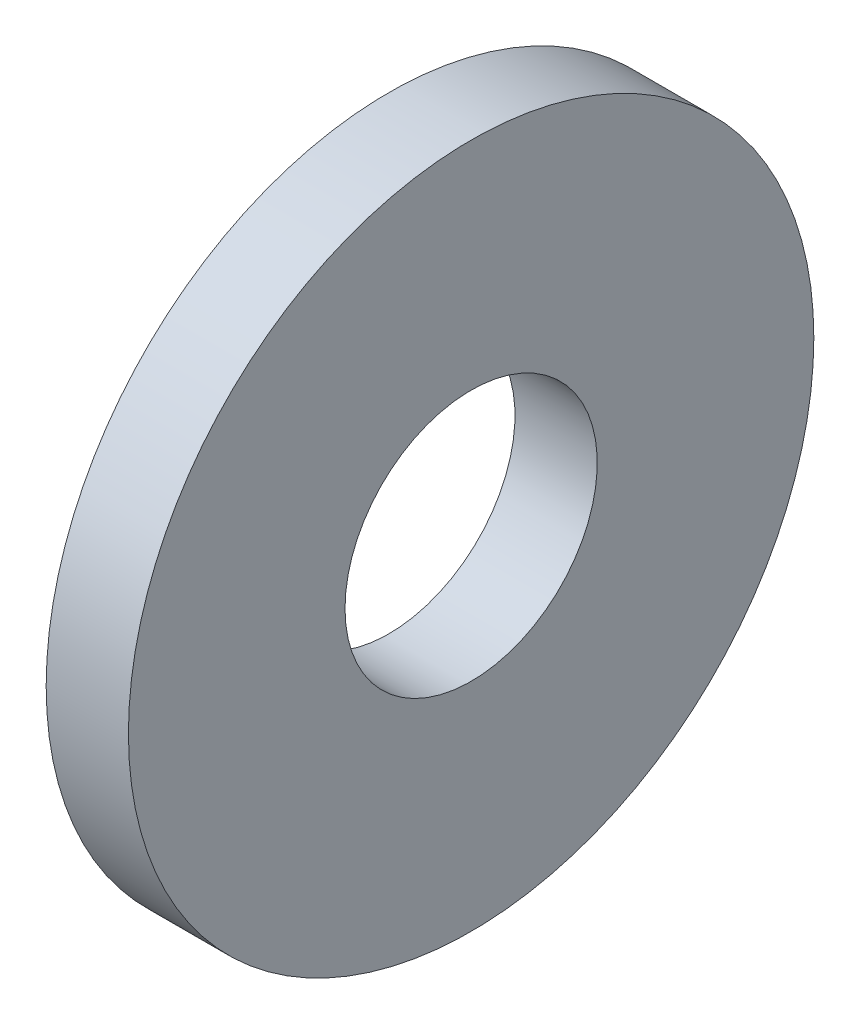
ISO-10303-21;
HEADER;
FILE_DESCRIPTION(('STEP AP214'),'2;1');
FILE_NAME('part.step','',(''),(''),'','','');
FILE_SCHEMA(('AUTOMOTIVE_DESIGN { 1 0 10303 214 1 1 1 1 }'));
ENDSEC;
DATA;
#1=APPLICATION_CONTEXT('core data for automotive mechanical design processes');
#2=APPLICATION_PROTOCOL_DEFINITION('international standard','automotive_design',2000,#1);
#3=PRODUCT_CONTEXT('',#1,'mechanical');
#4=PRODUCT('Part','Part','',(#3));
#5=PRODUCT_RELATED_PRODUCT_CATEGORY('part','',(#4));
#6=PRODUCT_DEFINITION_FORMATION('','',#4);
#7=PRODUCT_DEFINITION_CONTEXT('part definition',#1,'design');
#8=PRODUCT_DEFINITION('design','',#6,#7);
#9=PRODUCT_DEFINITION_SHAPE('','',#8);
#10=(LENGTH_UNIT() NAMED_UNIT(*) SI_UNIT(.MILLI.,.METRE.));
#11=(NAMED_UNIT(*) PLANE_ANGLE_UNIT() SI_UNIT($,.RADIAN.));
#12=(NAMED_UNIT(*) SI_UNIT($,.STERADIAN.) SOLID_ANGLE_UNIT());
#13=UNCERTAINTY_MEASURE_WITH_UNIT(LENGTH_MEASURE(1.E-05),#10,'distance_accuracy_value','');
#14=(GEOMETRIC_REPRESENTATION_CONTEXT(3) GLOBAL_UNCERTAINTY_ASSIGNED_CONTEXT((#13)) GLOBAL_UNIT_ASSIGNED_CONTEXT((#10,
#11,#12)) REPRESENTATION_CONTEXT('',''));
#15=CARTESIAN_POINT('',(0.,0.,0.));
#16=DIRECTION('',(0.,0.,1.));
#17=DIRECTION('',(1.,0.,0.));
#18=AXIS2_PLACEMENT_3D('',#15,#16,#17);
#19=CARTESIAN_POINT('',(-34.9249999999999,0.,0.));
#20=DIRECTION('',(-1.,0.,0.));
#21=DIRECTION('',(0.,0.,1.));
#22=AXIS2_PLACEMENT_3D('',#19,#20,#21);
#23=CYLINDRICAL_SURFACE('',#22,1.84);
#24=CARTESIAN_POINT('',(0.,0.,0.));
#25=DIRECTION('',(-1.,0.,0.));
#26=DIRECTION('',(0.,0.,1.));
#27=AXIS2_PLACEMENT_3D('',#24,#25,#26);
#28=CIRCLE('',#27,1.84);
#29=CARTESIAN_POINT('',(0.,0.,1.84));
#30=VERTEX_POINT('',#29);
#31=EDGE_CURVE('E10',#30,#30,#28,.T.);
#32=ORIENTED_EDGE('',*,*,#31,.F.);
#33=EDGE_LOOP('',(#32));
#34=FACE_BOUND('',#33,.T.);
#35=CARTESIAN_POINT('',(-1.2,0.,0.));
#36=DIRECTION('',(-1.,0.,0.));
#37=DIRECTION('',(0.,0.,1.));
#38=AXIS2_PLACEMENT_3D('',#35,#36,#37);
#39=CIRCLE('',#38,1.84);
#40=CARTESIAN_POINT('',(-1.2,0.,1.84));
#41=VERTEX_POINT('',#40);
#42=EDGE_CURVE('E41',#41,#41,#39,.T.);
#43=ORIENTED_EDGE('',*,*,#42,.T.);
#44=EDGE_LOOP('',(#43));
#45=FACE_BOUND('',#44,.T.);
#46=ADVANCED_FACE('F27',(#34,#45),#23,.F.);
#47=CARTESIAN_POINT('',(0.,1.84,0.));
#48=DIRECTION('',(-1.,0.,0.));
#49=DIRECTION('',(0.,0.,1.));
#50=AXIS2_PLACEMENT_3D('',#47,#48,#49);
#51=PLANE('',#50);
#52=CARTESIAN_POINT('',(0.,0.,0.));
#53=DIRECTION('',(-1.,0.,0.));
#54=DIRECTION('',(0.,0.,1.));
#55=AXIS2_PLACEMENT_3D('',#52,#53,#54);
#56=CIRCLE('',#55,5.);
#57=CARTESIAN_POINT('',(0.,0.,5.));
#58=VERTEX_POINT('',#57);
#59=EDGE_CURVE('E33',#58,#58,#56,.T.);
#60=ORIENTED_EDGE('',*,*,#59,.F.);
#61=EDGE_LOOP('',(#60));
#62=FACE_BOUND('',#61,.T.);
#63=ORIENTED_EDGE('',*,*,#31,.T.);
#64=EDGE_LOOP('',(#63));
#65=FACE_BOUND('',#64,.T.);
#66=ADVANCED_FACE('F56',(#62,#65),#51,.F.);
#67=CARTESIAN_POINT('',(-34.9249999999999,0.,0.));
#68=DIRECTION('',(-1.,0.,0.));
#69=DIRECTION('',(0.,0.,1.));
#70=AXIS2_PLACEMENT_3D('',#67,#68,#69);
#71=CYLINDRICAL_SURFACE('',#70,5.);
#72=CARTESIAN_POINT('',(-1.2,0.,0.));
#73=DIRECTION('',(-1.,0.,0.));
#74=DIRECTION('',(0.,0.,1.));
#75=AXIS2_PLACEMENT_3D('',#72,#73,#74);
#76=CIRCLE('',#75,5.);
#77=CARTESIAN_POINT('',(-1.2,0.,5.));
#78=VERTEX_POINT('',#77);
#79=EDGE_CURVE('E37',#78,#78,#76,.T.);
#80=ORIENTED_EDGE('',*,*,#79,.F.);
#81=EDGE_LOOP('',(#80));
#82=FACE_BOUND('',#81,.T.);
#83=ORIENTED_EDGE('',*,*,#59,.T.);
#84=EDGE_LOOP('',(#83));
#85=FACE_BOUND('',#84,.T.);
#86=ADVANCED_FACE('F51',(#82,#85),#71,.T.);
#87=CARTESIAN_POINT('',(-1.2,5.,0.));
#88=DIRECTION('',(1.,0.,0.));
#89=DIRECTION('',(0.,0.,-1.));
#90=AXIS2_PLACEMENT_3D('',#87,#88,#89);
#91=PLANE('',#90);
#92=ORIENTED_EDGE('',*,*,#42,.F.);
#93=EDGE_LOOP('',(#92));
#94=FACE_BOUND('',#93,.T.);
#95=ORIENTED_EDGE('',*,*,#79,.T.);
#96=EDGE_LOOP('',(#95));
#97=FACE_BOUND('',#96,.T.);
#98=ADVANCED_FACE('F48',(#94,#97),#91,.F.);
#99=CLOSED_SHELL('',(#46,#66,#86,#98));
#100=MANIFOLD_SOLID_BREP('B2',#99);
#101=ADVANCED_BREP_SHAPE_REPRESENTATION('',(#18,#100),#14);
#102=SHAPE_DEFINITION_REPRESENTATION(#9,#101);
ENDSEC;
END-ISO-10303-21;
